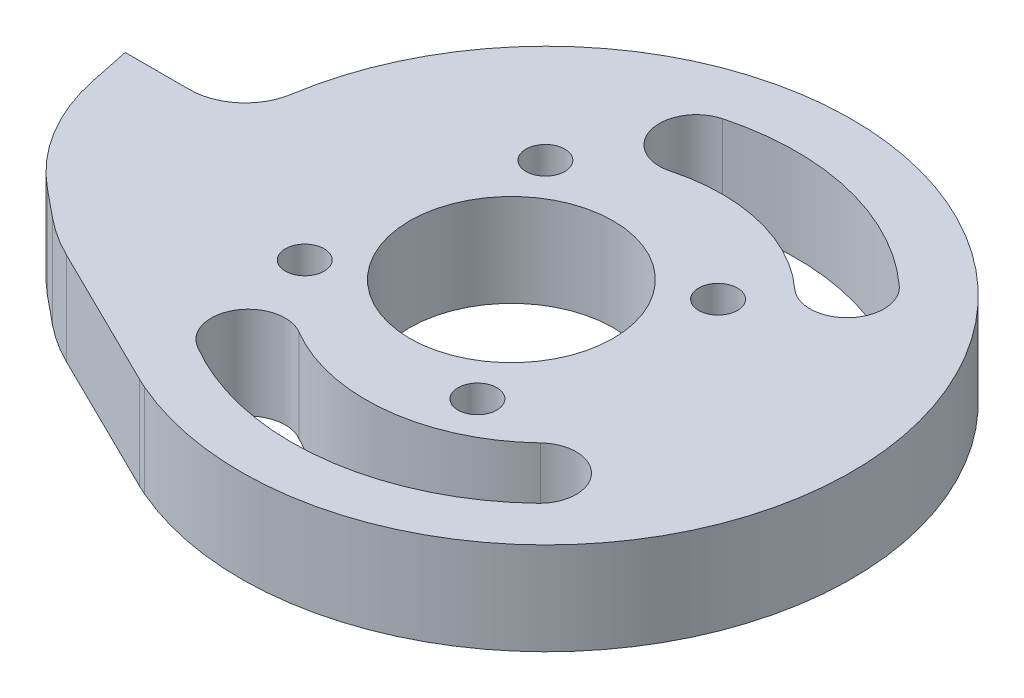
ISO-10303-21;
HEADER;
FILE_DESCRIPTION(('STEP AP214'),'2;1');
FILE_NAME('part.step','',(''),(''),'','','');
FILE_SCHEMA(('AUTOMOTIVE_DESIGN { 1 0 10303 214 1 1 1 1 }'));
ENDSEC;
DATA;
#1=APPLICATION_CONTEXT('core data for automotive mechanical design processes');
#2=APPLICATION_PROTOCOL_DEFINITION('international standard','automotive_design',2000,#1);
#3=PRODUCT_CONTEXT('',#1,'mechanical');
#4=PRODUCT('Part','Part','',(#3));
#5=PRODUCT_RELATED_PRODUCT_CATEGORY('part','',(#4));
#6=PRODUCT_DEFINITION_FORMATION('','',#4);
#7=PRODUCT_DEFINITION_CONTEXT('part definition',#1,'design');
#8=PRODUCT_DEFINITION('design','',#6,#7);
#9=PRODUCT_DEFINITION_SHAPE('','',#8);
#10=(LENGTH_UNIT() NAMED_UNIT(*) SI_UNIT(.MILLI.,.METRE.));
#11=(NAMED_UNIT(*) PLANE_ANGLE_UNIT() SI_UNIT($,.RADIAN.));
#12=(NAMED_UNIT(*) SI_UNIT($,.STERADIAN.) SOLID_ANGLE_UNIT());
#13=UNCERTAINTY_MEASURE_WITH_UNIT(LENGTH_MEASURE(1.E-05),#10,'distance_accuracy_value','');
#14=(GEOMETRIC_REPRESENTATION_CONTEXT(3) GLOBAL_UNCERTAINTY_ASSIGNED_CONTEXT((#13)) GLOBAL_UNIT_ASSIGNED_CONTEXT((#10,
#11,#12)) REPRESENTATION_CONTEXT('',''));
#15=CARTESIAN_POINT('',(0.,0.,0.));
#16=DIRECTION('',(0.,0.,1.));
#17=DIRECTION('',(1.,0.,0.));
#18=AXIS2_PLACEMENT_3D('',#15,#16,#17);
#19=CARTESIAN_POINT('',(0.,10.,0.));
#20=DIRECTION('',(0.,-1.,0.));
#21=DIRECTION('',(0.,0.,-1.));
#22=AXIS2_PLACEMENT_3D('',#19,#20,#21);
#23=PLANE('',#22);
#24=CARTESIAN_POINT('',(0.,10.,0.));
#25=DIRECTION('',(0.,1.,0.));
#26=DIRECTION('',(0.,0.,1.));
#27=AXIS2_PLACEMENT_3D('',#24,#25,#26);
#28=CIRCLE('',#27,27.5);
#29=CARTESIAN_POINT('',(-14.0425531914894,10.,23.6443798790366));
#30=VERTEX_POINT('',#29);
#31=CARTESIAN_POINT('',(18.9866795888795,10.,19.8936170212766));
#32=VERTEX_POINT('',#31);
#33=EDGE_CURVE('E189',#30,#32,#28,.T.);
#34=ORIENTED_EDGE('',*,*,#33,.F.);
#35=CARTESIAN_POINT('',(-12.,10.,20.2051973511768));
#36=DIRECTION('',(0.,1.,0.));
#37=DIRECTION('',(0.,0.,1.));
#38=AXIS2_PLACEMENT_3D('',#35,#36,#37);
#39=CIRCLE('',#38,4.);
#40=CARTESIAN_POINT('',(-9.95744680851064,10.,16.7660148233169));
#41=VERTEX_POINT('',#40);
#42=EDGE_CURVE('E162',#41,#30,#39,.T.);
#43=ORIENTED_EDGE('',*,*,#42,.F.);
#44=CARTESIAN_POINT('',(0.,10.,0.));
#45=DIRECTION('',(0.,-1.,0.));
#46=DIRECTION('',(0.,0.,1.));
#47=AXIS2_PLACEMENT_3D('',#44,#45,#46);
#48=CIRCLE('',#47,19.5);
#49=CARTESIAN_POINT('',(13.4632818902964,10.,14.1063829787234));
#50=VERTEX_POINT('',#49);
#51=EDGE_CURVE('E180',#50,#41,#48,.T.);
#52=ORIENTED_EDGE('',*,*,#51,.F.);
#53=CARTESIAN_POINT('',(16.224980739588,10.,17.));
#54=DIRECTION('',(0.,1.,0.));
#55=DIRECTION('',(0.,0.,1.));
#56=AXIS2_PLACEMENT_3D('',#53,#54,#55);
#57=CIRCLE('',#56,4.);
#58=EDGE_CURVE('E183',#32,#50,#57,.T.);
#59=ORIENTED_EDGE('',*,*,#58,.F.);
#60=EDGE_LOOP('',(#34,#43,#52,#59));
#61=FACE_BOUND('',#60,.T.);
#62=CARTESIAN_POINT('',(0.,10.,0.));
#63=DIRECTION('',(0.,1.,0.));
#64=DIRECTION('',(0.,0.,1.));
#65=AXIS2_PLACEMENT_3D('',#62,#63,#64);
#66=CIRCLE('',#65,27.);
#67=CARTESIAN_POINT('',(18.1861826691479,10.,-19.9565217391304));
#68=VERTEX_POINT('',#67);
#69=CARTESIAN_POINT('',(-7.04347826086956,10.,-26.0650995392049));
#70=VERTEX_POINT('',#69);
#71=EDGE_CURVE('E216',#68,#70,#66,.T.);
#72=ORIENTED_EDGE('',*,*,#71,.F.);
#73=CARTESIAN_POINT('',(15.4919333848297,10.,-17.));
#74=DIRECTION('',(0.,1.,0.));
#75=DIRECTION('',(0.,0.,1.));
#76=AXIS2_PLACEMENT_3D('',#73,#74,#75);
#77=CIRCLE('',#76,4.);
#78=CARTESIAN_POINT('',(12.7976841005115,10.,-14.0434782608696));
#79=VERTEX_POINT('',#78);
#80=EDGE_CURVE('E214',#79,#68,#77,.T.);
#81=ORIENTED_EDGE('',*,*,#80,.F.);
#82=CARTESIAN_POINT('',(0.,10.,0.));
#83=DIRECTION('',(0.,-1.,0.));
#84=DIRECTION('',(0.,0.,1.));
#85=AXIS2_PLACEMENT_3D('',#82,#83,#84);
#86=CIRCLE('',#85,19.);
#87=CARTESIAN_POINT('',(-4.95652173913044,10.,-18.3421070831442));
#88=VERTEX_POINT('',#87);
#89=EDGE_CURVE('E204',#88,#79,#86,.T.);
#90=ORIENTED_EDGE('',*,*,#89,.F.);
#91=CARTESIAN_POINT('',(-6.,10.,-22.2036033111745));
#92=DIRECTION('',(0.,1.,0.));
#93=DIRECTION('',(0.,0.,1.));
#94=AXIS2_PLACEMENT_3D('',#91,#92,#93);
#95=CIRCLE('',#94,4.);
#96=EDGE_CURVE('E219',#70,#88,#95,.T.);
#97=ORIENTED_EDGE('',*,*,#96,.F.);
#98=EDGE_LOOP('',(#72,#81,#90,#97));
#99=FACE_BOUND('',#98,.T.);
#100=CARTESIAN_POINT('',(-12.7073790530888,10.,-12.61));
#101=DIRECTION('',(0.,1.,0.));
#102=DIRECTION('',(0.,0.,1.));
#103=AXIS2_PLACEMENT_3D('',#100,#101,#102);
#104=CIRCLE('',#103,2.1);
#105=CARTESIAN_POINT('',(-12.7073790530888,10.,-10.51));
#106=VERTEX_POINT('',#105);
#107=EDGE_CURVE('E196',#106,#106,#104,.T.);
#108=ORIENTED_EDGE('',*,*,#107,.F.);
#109=EDGE_LOOP('',(#108));
#110=FACE_BOUND('',#109,.T.);
#111=CARTESIAN_POINT('',(-16.38,10.,9.71737905308882));
#112=DIRECTION('',(0.,1.,0.));
#113=DIRECTION('',(0.,0.,1.));
#114=AXIS2_PLACEMENT_3D('',#111,#112,#113);
#115=CIRCLE('',#114,2.1);
#116=CARTESIAN_POINT('',(-16.38,10.,11.8173790530888));
#117=VERTEX_POINT('',#116);
#118=EDGE_CURVE('E241',#117,#117,#115,.T.);
#119=ORIENTED_EDGE('',*,*,#118,.F.);
#120=EDGE_LOOP('',(#119));
#121=FACE_BOUND('',#120,.T.);
#122=CARTESIAN_POINT('',(5.94737905308882,10.,13.39));
#123=DIRECTION('',(0.,1.,0.));
#124=DIRECTION('',(0.,0.,1.));
#125=AXIS2_PLACEMENT_3D('',#122,#123,#124);
#126=CIRCLE('',#125,2.09999999999999);
#127=CARTESIAN_POINT('',(5.94737905308882,10.,15.49));
#128=VERTEX_POINT('',#127);
#129=EDGE_CURVE('E235',#128,#128,#126,.T.);
#130=ORIENTED_EDGE('',*,*,#129,.F.);
#131=EDGE_LOOP('',(#130));
#132=FACE_BOUND('',#131,.T.);
#133=CARTESIAN_POINT('',(9.62,10.,-8.93737905308882));
#134=DIRECTION('',(0.,1.,0.));
#135=DIRECTION('',(0.,0.,1.));
#136=AXIS2_PLACEMENT_3D('',#133,#134,#135);
#137=CIRCLE('',#136,2.1);
#138=CARTESIAN_POINT('',(9.62,10.,-6.83737905308882));
#139=VERTEX_POINT('',#138);
#140=EDGE_CURVE('E234',#139,#139,#137,.T.);
#141=ORIENTED_EDGE('',*,*,#140,.F.);
#142=EDGE_LOOP('',(#141));
#143=FACE_BOUND('',#142,.T.);
#144=DIRECTION('',(0.896892718197446,0.,0.442248179243732));
#145=VECTOR('',#144,1.);
#146=CARTESIAN_POINT('',(-32.,10.,21.));
#147=LINE('',#146,#145);
#148=CARTESIAN_POINT('',(-29.7445383063231,10.,22.1121439689992));
#149=VERTEX_POINT('',#148);
#150=CARTESIAN_POINT('',(-14.1030942068052,10.,29.8247722838514));
#151=VERTEX_POINT('',#150);
#152=EDGE_CURVE('E270',#149,#151,#147,.T.);
#153=ORIENTED_EDGE('',*,*,#152,.T.);
#154=CARTESIAN_POINT('',(-4.3736342634431,10.,10.0931324835076));
#155=DIRECTION('',(0.,-1.,0.));
#156=DIRECTION('',(0.,0.,-1.));
#157=AXIS2_PLACEMENT_3D('',#154,#155,#156);
#158=CIRCLE('',#157,22.);
#159=CARTESIAN_POINT('',(-13.1209027903293,10.,30.2793974505228));
#160=VERTEX_POINT('',#159);
#161=EDGE_CURVE('E314',#151,#160,#158,.F.);
#162=ORIENTED_EDGE('',*,*,#161,.T.);
#163=CARTESIAN_POINT('',(0.,10.,0.));
#164=DIRECTION('',(0.,1.,0.));
#165=DIRECTION('',(0.,0.,-1.));
#166=AXIS2_PLACEMENT_3D('',#163,#164,#165);
#167=CIRCLE('',#166,33.);
#168=CARTESIAN_POINT('',(-32.6071288535346,10.,-5.07692307692307));
#169=VERTEX_POINT('',#168);
#170=EDGE_CURVE('E261',#160,#169,#167,.T.);
#171=ORIENTED_EDGE('',*,*,#170,.T.);
#172=CARTESIAN_POINT('',(-38.5356977359954,10.,-6.));
#173=DIRECTION('',(0.,-1.,0.));
#174=DIRECTION('',(0.,0.,-1.));
#175=AXIS2_PLACEMENT_3D('',#172,#173,#174);
#176=CIRCLE('',#175,6.);
#177=CARTESIAN_POINT('',(-38.5356977359954,10.,0.));
#178=VERTEX_POINT('',#177);
#179=EDGE_CURVE('E295',#169,#178,#176,.T.);
#180=ORIENTED_EDGE('',*,*,#179,.T.);
#181=DIRECTION('',(-1.,0.,0.));
#182=VECTOR('',#181,1.);
#183=CARTESIAN_POINT('',(-33.,10.,0.));
#184=LINE('',#183,#182);
#185=CARTESIAN_POINT('',(-45.5,10.,0.));
#186=VERTEX_POINT('',#185);
#187=EDGE_CURVE('E263',#178,#186,#184,.T.);
#188=ORIENTED_EDGE('',*,*,#187,.T.);
#189=DIRECTION('',(0.203954254112001,0.,0.978980419737605));
#190=VECTOR('',#189,1.);
#191=CARTESIAN_POINT('',(-45.5,10.,0.));
#192=LINE('',#191,#190);
#193=CARTESIAN_POINT('',(-44.586385759703,10.,4.38534835342558));
#194=VERTEX_POINT('',#193);
#195=EDGE_CURVE('E266',#186,#194,#192,.T.);
#196=ORIENTED_EDGE('',*,*,#195,.T.);
#197=CARTESIAN_POINT('',(-23.0488165254757,10.,-0.101645237038444));
#198=DIRECTION('',(0.,-1.,0.));
#199=DIRECTION('',(0.,0.,-1.));
#200=AXIS2_PLACEMENT_3D('',#197,#198,#199);
#201=CIRCLE('',#200,22.);
#202=CARTESIAN_POINT('',(-36.9800479111355,10.,16.9254153454346));
#203=VERTEX_POINT('',#202);
#204=EDGE_CURVE('E57',#194,#203,#201,.F.);
#205=ORIENTED_EDGE('',*,*,#204,.T.);
#206=DIRECTION('',(0.773957299203321,0.,0.633237790257263));
#207=VECTOR('',#206,1.);
#208=CARTESIAN_POINT('',(-43.,10.,12.));
#209=LINE('',#208,#207);
#210=CARTESIAN_POINT('',(-33.9463097486208,10.,19.4075647511284));
#211=VERTEX_POINT('',#210);
#212=EDGE_CURVE('E268',#203,#211,#209,.T.);
#213=ORIENTED_EDGE('',*,*,#212,.T.);
#214=CARTESIAN_POINT('',(-20.015078362961,10.,2.38050416865538));
#215=DIRECTION('',(0.,-1.,0.));
#216=DIRECTION('',(0.,0.,-1.));
#217=AXIS2_PLACEMENT_3D('',#214,#215,#216);
#218=CIRCLE('',#217,22.);
#219=EDGE_CURVE('E312',#211,#149,#218,.F.);
#220=ORIENTED_EDGE('',*,*,#219,.T.);
#221=EDGE_LOOP('',(#153,#162,#171,#180,#188,#196,#205,#213,#220));
#222=FACE_BOUND('',#221,.T.);
#223=CARTESIAN_POINT('',(-3.38,10.,0.39));
#224=DIRECTION('',(0.,1.,0.));
#225=DIRECTION('',(0.,0.,1.));
#226=AXIS2_PLACEMENT_3D('',#223,#224,#225);
#227=CIRCLE('',#226,11.);
#228=CARTESIAN_POINT('',(-3.38,10.,11.39));
#229=VERTEX_POINT('',#228);
#230=EDGE_CURVE('E255',#229,#229,#227,.T.);
#231=ORIENTED_EDGE('',*,*,#230,.F.);
#232=EDGE_LOOP('',(#231));
#233=FACE_BOUND('',#232,.T.);
#234=ADVANCED_FACE('F36',(#61,#99,#110,#121,#132,#143,#222,#233),#23,.F.);
#235=CARTESIAN_POINT('',(0.,0.,0.));
#236=DIRECTION('',(0.,-1.,0.));
#237=DIRECTION('',(0.,0.,-1.));
#238=AXIS2_PLACEMENT_3D('',#235,#236,#237);
#239=PLANE('',#238);
#240=CARTESIAN_POINT('',(-12.,0.,20.2051973511768));
#241=DIRECTION('',(0.,1.,0.));
#242=DIRECTION('',(0.,0.,1.));
#243=AXIS2_PLACEMENT_3D('',#240,#241,#242);
#244=CIRCLE('',#243,4.);
#245=CARTESIAN_POINT('',(-9.95744680851064,0.,16.7660148233169));
#246=VERTEX_POINT('',#245);
#247=CARTESIAN_POINT('',(-14.0425531914894,0.,23.6443798790366));
#248=VERTEX_POINT('',#247);
#249=EDGE_CURVE('E159',#246,#248,#244,.T.);
#250=ORIENTED_EDGE('',*,*,#249,.T.);
#251=CARTESIAN_POINT('',(0.,0.,0.));
#252=DIRECTION('',(0.,1.,0.));
#253=DIRECTION('',(0.,0.,1.));
#254=AXIS2_PLACEMENT_3D('',#251,#252,#253);
#255=CIRCLE('',#254,27.5);
#256=CARTESIAN_POINT('',(18.9866795888795,0.,19.8936170212766));
#257=VERTEX_POINT('',#256);
#258=EDGE_CURVE('E171',#248,#257,#255,.T.);
#259=ORIENTED_EDGE('',*,*,#258,.T.);
#260=CARTESIAN_POINT('',(16.224980739588,0.,17.));
#261=DIRECTION('',(0.,1.,0.));
#262=DIRECTION('',(0.,0.,1.));
#263=AXIS2_PLACEMENT_3D('',#260,#261,#262);
#264=CIRCLE('',#263,4.);
#265=CARTESIAN_POINT('',(13.4632818902964,0.,14.1063829787234));
#266=VERTEX_POINT('',#265);
#267=EDGE_CURVE('E175',#257,#266,#264,.T.);
#268=ORIENTED_EDGE('',*,*,#267,.T.);
#269=CARTESIAN_POINT('',(0.,0.,0.));
#270=DIRECTION('',(0.,-1.,0.));
#271=DIRECTION('',(0.,0.,1.));
#272=AXIS2_PLACEMENT_3D('',#269,#270,#271);
#273=CIRCLE('',#272,19.5);
#274=EDGE_CURVE('E167',#266,#246,#273,.T.);
#275=ORIENTED_EDGE('',*,*,#274,.T.);
#276=EDGE_LOOP('',(#250,#259,#268,#275));
#277=FACE_BOUND('',#276,.T.);
#278=CARTESIAN_POINT('',(15.4919333848297,0.,-17.));
#279=DIRECTION('',(0.,1.,0.));
#280=DIRECTION('',(0.,0.,1.));
#281=AXIS2_PLACEMENT_3D('',#278,#279,#280);
#282=CIRCLE('',#281,4.);
#283=CARTESIAN_POINT('',(12.7976841005115,0.,-14.0434782608696));
#284=VERTEX_POINT('',#283);
#285=CARTESIAN_POINT('',(18.1861826691479,0.,-19.9565217391304));
#286=VERTEX_POINT('',#285);
#287=EDGE_CURVE('E200',#284,#286,#282,.T.);
#288=ORIENTED_EDGE('',*,*,#287,.T.);
#289=CARTESIAN_POINT('',(0.,0.,0.));
#290=DIRECTION('',(0.,1.,0.));
#291=DIRECTION('',(0.,0.,1.));
#292=AXIS2_PLACEMENT_3D('',#289,#290,#291);
#293=CIRCLE('',#292,27.);
#294=CARTESIAN_POINT('',(-7.04347826086956,0.,-26.0650995392049));
#295=VERTEX_POINT('',#294);
#296=EDGE_CURVE('E203',#286,#295,#293,.T.);
#297=ORIENTED_EDGE('',*,*,#296,.T.);
#298=CARTESIAN_POINT('',(-6.,0.,-22.2036033111745));
#299=DIRECTION('',(0.,1.,0.));
#300=DIRECTION('',(0.,0.,1.));
#301=AXIS2_PLACEMENT_3D('',#298,#299,#300);
#302=CIRCLE('',#301,4.);
#303=CARTESIAN_POINT('',(-4.95652173913044,0.,-18.3421070831442));
#304=VERTEX_POINT('',#303);
#305=EDGE_CURVE('E207',#295,#304,#302,.T.);
#306=ORIENTED_EDGE('',*,*,#305,.T.);
#307=CARTESIAN_POINT('',(0.,0.,0.));
#308=DIRECTION('',(0.,-1.,0.));
#309=DIRECTION('',(0.,0.,1.));
#310=AXIS2_PLACEMENT_3D('',#307,#308,#309);
#311=CIRCLE('',#310,19.);
#312=EDGE_CURVE('E210',#304,#284,#311,.T.);
#313=ORIENTED_EDGE('',*,*,#312,.T.);
#314=EDGE_LOOP('',(#288,#297,#306,#313));
#315=FACE_BOUND('',#314,.T.);
#316=CARTESIAN_POINT('',(-12.7073790530888,0.,-12.61));
#317=DIRECTION('',(0.,1.,0.));
#318=DIRECTION('',(0.,0.,1.));
#319=AXIS2_PLACEMENT_3D('',#316,#317,#318);
#320=CIRCLE('',#319,2.1);
#321=CARTESIAN_POINT('',(-12.7073790530888,0.,-10.51));
#322=VERTEX_POINT('',#321);
#323=EDGE_CURVE('E244',#322,#322,#320,.T.);
#324=ORIENTED_EDGE('',*,*,#323,.T.);
#325=EDGE_LOOP('',(#324));
#326=FACE_BOUND('',#325,.T.);
#327=CARTESIAN_POINT('',(-16.38,0.,9.71737905308882));
#328=DIRECTION('',(0.,1.,0.));
#329=DIRECTION('',(0.,0.,1.));
#330=AXIS2_PLACEMENT_3D('',#327,#328,#329);
#331=CIRCLE('',#330,2.1);
#332=CARTESIAN_POINT('',(-16.38,0.,11.8173790530888));
#333=VERTEX_POINT('',#332);
#334=EDGE_CURVE('E238',#333,#333,#331,.T.);
#335=ORIENTED_EDGE('',*,*,#334,.T.);
#336=EDGE_LOOP('',(#335));
#337=FACE_BOUND('',#336,.T.);
#338=CARTESIAN_POINT('',(5.94737905308882,0.,13.39));
#339=DIRECTION('',(0.,1.,0.));
#340=DIRECTION('',(0.,0.,1.));
#341=AXIS2_PLACEMENT_3D('',#338,#339,#340);
#342=CIRCLE('',#341,2.09999999999999);
#343=CARTESIAN_POINT('',(5.94737905308882,0.,15.49));
#344=VERTEX_POINT('',#343);
#345=EDGE_CURVE('E231',#344,#344,#342,.T.);
#346=ORIENTED_EDGE('',*,*,#345,.T.);
#347=EDGE_LOOP('',(#346));
#348=FACE_BOUND('',#347,.T.);
#349=CARTESIAN_POINT('',(9.62,0.,-8.93737905308882));
#350=DIRECTION('',(0.,1.,0.));
#351=DIRECTION('',(0.,0.,1.));
#352=AXIS2_PLACEMENT_3D('',#349,#350,#351);
#353=CIRCLE('',#352,2.1);
#354=CARTESIAN_POINT('',(9.62,0.,-6.83737905308882));
#355=VERTEX_POINT('',#354);
#356=EDGE_CURVE('E249',#355,#355,#353,.T.);
#357=ORIENTED_EDGE('',*,*,#356,.T.);
#358=EDGE_LOOP('',(#357));
#359=FACE_BOUND('',#358,.T.);
#360=CARTESIAN_POINT('',(0.,0.,0.));
#361=DIRECTION('',(0.,1.,0.));
#362=DIRECTION('',(0.,0.,-1.));
#363=AXIS2_PLACEMENT_3D('',#360,#361,#362);
#364=CIRCLE('',#363,33.);
#365=CARTESIAN_POINT('',(-13.1209027903293,0.,30.2793974505228));
#366=VERTEX_POINT('',#365);
#367=CARTESIAN_POINT('',(-32.6071288535346,0.,-5.07692307692307));
#368=VERTEX_POINT('',#367);
#369=EDGE_CURVE('E258',#366,#368,#364,.T.);
#370=ORIENTED_EDGE('',*,*,#369,.F.);
#371=CARTESIAN_POINT('',(-4.3736342634431,0.,10.0931324835076));
#372=DIRECTION('',(0.,-1.,0.));
#373=DIRECTION('',(0.,0.,-1.));
#374=AXIS2_PLACEMENT_3D('',#371,#372,#373);
#375=CIRCLE('',#374,22.);
#376=CARTESIAN_POINT('',(-14.1030942068052,0.,29.8247722838514));
#377=VERTEX_POINT('',#376);
#378=EDGE_CURVE('E304',#366,#377,#375,.T.);
#379=ORIENTED_EDGE('',*,*,#378,.T.);
#380=DIRECTION('',(0.896892718197446,0.,0.442248179243732));
#381=VECTOR('',#380,1.);
#382=CARTESIAN_POINT('',(-32.,0.,21.));
#383=LINE('',#382,#381);
#384=CARTESIAN_POINT('',(-29.7445383063231,0.,22.1121439689992));
#385=VERTEX_POINT('',#384);
#386=EDGE_CURVE('E264',#385,#377,#383,.T.);
#387=ORIENTED_EDGE('',*,*,#386,.F.);
#388=CARTESIAN_POINT('',(-20.015078362961,0.,2.38050416865538));
#389=DIRECTION('',(0.,-1.,0.));
#390=DIRECTION('',(0.,0.,-1.));
#391=AXIS2_PLACEMENT_3D('',#388,#389,#390);
#392=CIRCLE('',#391,22.);
#393=CARTESIAN_POINT('',(-33.9463097486208,0.,19.4075647511284));
#394=VERTEX_POINT('',#393);
#395=EDGE_CURVE('E302',#385,#394,#392,.T.);
#396=ORIENTED_EDGE('',*,*,#395,.T.);
#397=DIRECTION('',(0.773957299203321,0.,0.633237790257263));
#398=VECTOR('',#397,1.);
#399=CARTESIAN_POINT('',(-43.,0.,12.));
#400=LINE('',#399,#398);
#401=CARTESIAN_POINT('',(-36.9800479111355,0.,16.9254153454346));
#402=VERTEX_POINT('',#401);
#403=EDGE_CURVE('E280',#402,#394,#400,.T.);
#404=ORIENTED_EDGE('',*,*,#403,.F.);
#405=CARTESIAN_POINT('',(-23.0488165254757,0.,-0.101645237038444));
#406=DIRECTION('',(0.,-1.,0.));
#407=DIRECTION('',(0.,0.,-1.));
#408=AXIS2_PLACEMENT_3D('',#405,#406,#407);
#409=CIRCLE('',#408,22.);
#410=CARTESIAN_POINT('',(-44.586385759703,0.,4.38534835342558));
#411=VERTEX_POINT('',#410);
#412=EDGE_CURVE('E300',#402,#411,#409,.T.);
#413=ORIENTED_EDGE('',*,*,#412,.T.);
#414=DIRECTION('',(0.203954254112001,0.,0.978980419737605));
#415=VECTOR('',#414,1.);
#416=CARTESIAN_POINT('',(-45.5,0.,0.));
#417=LINE('',#416,#415);
#418=CARTESIAN_POINT('',(-45.5,0.,0.));
#419=VERTEX_POINT('',#418);
#420=EDGE_CURVE('E277',#419,#411,#417,.T.);
#421=ORIENTED_EDGE('',*,*,#420,.F.);
#422=DIRECTION('',(-1.,0.,0.));
#423=VECTOR('',#422,1.);
#424=CARTESIAN_POINT('',(-33.,0.,0.));
#425=LINE('',#424,#423);
#426=CARTESIAN_POINT('',(-38.5356977359954,0.,0.));
#427=VERTEX_POINT('',#426);
#428=EDGE_CURVE('E275',#427,#419,#425,.T.);
#429=ORIENTED_EDGE('',*,*,#428,.F.);
#430=CARTESIAN_POINT('',(-38.5356977359954,0.,-6.));
#431=DIRECTION('',(0.,-1.,0.));
#432=DIRECTION('',(0.,0.,-1.));
#433=AXIS2_PLACEMENT_3D('',#430,#431,#432);
#434=CIRCLE('',#433,6.);
#435=EDGE_CURVE('E292',#427,#368,#434,.F.);
#436=ORIENTED_EDGE('',*,*,#435,.T.);
#437=EDGE_LOOP('',(#370,#379,#387,#396,#404,#413,#421,#429,#436));
#438=FACE_BOUND('',#437,.T.);
#439=CARTESIAN_POINT('',(-3.38,0.,0.39));
#440=DIRECTION('',(0.,1.,0.));
#441=DIRECTION('',(0.,0.,1.));
#442=AXIS2_PLACEMENT_3D('',#439,#440,#441);
#443=CIRCLE('',#442,11.);
#444=CARTESIAN_POINT('',(-3.38,0.,11.39));
#445=VERTEX_POINT('',#444);
#446=EDGE_CURVE('E252',#445,#445,#443,.T.);
#447=ORIENTED_EDGE('',*,*,#446,.T.);
#448=EDGE_LOOP('',(#447));
#449=FACE_BOUND('',#448,.T.);
#450=ADVANCED_FACE('F177',(#277,#315,#326,#337,#348,#359,#438,#449),#239,.T.);
#451=CARTESIAN_POINT('',(0.,10.,0.));
#452=DIRECTION('',(0.,-1.,0.));
#453=DIRECTION('',(0.,0.,-1.));
#454=AXIS2_PLACEMENT_3D('',#451,#452,#453);
#455=CYLINDRICAL_SURFACE('',#454,33.);
#456=ORIENTED_EDGE('',*,*,#170,.F.);
#457=DIRECTION('',(0.,-1.,0.));
#458=VECTOR('',#457,1.);
#459=CARTESIAN_POINT('',(-13.1209027903293,10.,30.2793974505228));
#460=LINE('',#459,#458);
#461=EDGE_CURVE('E297',#160,#366,#460,.T.);
#462=ORIENTED_EDGE('',*,*,#461,.T.);
#463=ORIENTED_EDGE('',*,*,#369,.T.);
#464=DIRECTION('',(0.,-1.,0.));
#465=VECTOR('',#464,1.);
#466=CARTESIAN_POINT('',(-32.6071288535346,10.,-5.07692307692307));
#467=LINE('',#466,#465);
#468=EDGE_CURVE('E289',#368,#169,#467,.F.);
#469=ORIENTED_EDGE('',*,*,#468,.T.);
#470=EDGE_LOOP('',(#456,#462,#463,#469));
#471=FACE_BOUND('',#470,.T.);
#472=ADVANCED_FACE('F342',(#471),#455,.T.);
#473=CARTESIAN_POINT('',(-33.,10.,0.));
#474=DIRECTION('',(0.,0.,1.));
#475=DIRECTION('',(1.,0.,0.));
#476=AXIS2_PLACEMENT_3D('',#473,#474,#475);
#477=PLANE('',#476);
#478=ORIENTED_EDGE('',*,*,#187,.F.);
#479=DIRECTION('',(0.,1.,0.));
#480=VECTOR('',#479,1.);
#481=CARTESIAN_POINT('',(-38.5356977359954,0.,0.));
#482=LINE('',#481,#480);
#483=EDGE_CURVE('E286',#178,#427,#482,.F.);
#484=ORIENTED_EDGE('',*,*,#483,.T.);
#485=ORIENTED_EDGE('',*,*,#428,.T.);
#486=DIRECTION('',(0.,-1.,0.));
#487=VECTOR('',#486,1.);
#488=CARTESIAN_POINT('',(-45.5,10.,0.));
#489=LINE('',#488,#487);
#490=EDGE_CURVE('E273',#186,#419,#489,.T.);
#491=ORIENTED_EDGE('',*,*,#490,.F.);
#492=EDGE_LOOP('',(#478,#484,#485,#491));
#493=FACE_BOUND('',#492,.T.);
#494=ADVANCED_FACE('F352',(#493),#477,.F.);
#495=CARTESIAN_POINT('',(-45.5,10.,0.));
#496=DIRECTION('',(0.978980419737605,0.,-0.203954254112001));
#497=DIRECTION('',(-0.203954254112001,0.,-0.978980419737605));
#498=AXIS2_PLACEMENT_3D('',#495,#496,#497);
#499=PLANE('',#498);
#500=ORIENTED_EDGE('',*,*,#420,.T.);
#501=DIRECTION('',(0.,-1.,0.));
#502=VECTOR('',#501,1.);
#503=CARTESIAN_POINT('',(-44.586385759703,10.,4.38534835342558));
#504=LINE('',#503,#502);
#505=EDGE_CURVE('E11',#411,#194,#504,.F.);
#506=ORIENTED_EDGE('',*,*,#505,.T.);
#507=ORIENTED_EDGE('',*,*,#195,.F.);
#508=ORIENTED_EDGE('',*,*,#490,.T.);
#509=EDGE_LOOP('',(#500,#506,#507,#508));
#510=FACE_BOUND('',#509,.T.);
#511=ADVANCED_FACE('F355',(#510),#499,.F.);
#512=CARTESIAN_POINT('',(-43.,10.,12.));
#513=DIRECTION('',(0.633237790257263,0.,-0.773957299203321));
#514=DIRECTION('',(-0.773957299203321,0.,-0.633237790257263));
#515=AXIS2_PLACEMENT_3D('',#512,#513,#514);
#516=PLANE('',#515);
#517=ORIENTED_EDGE('',*,*,#403,.T.);
#518=DIRECTION('',(0.,-1.,0.));
#519=VECTOR('',#518,1.);
#520=CARTESIAN_POINT('',(-33.9463097486208,10.,19.4075647511284));
#521=LINE('',#520,#519);
#522=EDGE_CURVE('E44',#394,#211,#521,.F.);
#523=ORIENTED_EDGE('',*,*,#522,.T.);
#524=ORIENTED_EDGE('',*,*,#212,.F.);
#525=DIRECTION('',(0.,-1.,0.));
#526=VECTOR('',#525,1.);
#527=CARTESIAN_POINT('',(-36.9800479111355,10.,16.9254153454346));
#528=LINE('',#527,#526);
#529=EDGE_CURVE('E316',#203,#402,#528,.T.);
#530=ORIENTED_EDGE('',*,*,#529,.T.);
#531=EDGE_LOOP('',(#517,#523,#524,#530));
#532=FACE_BOUND('',#531,.T.);
#533=ADVANCED_FACE('F320',(#532),#516,.F.);
#534=CARTESIAN_POINT('',(-32.,10.,21.));
#535=DIRECTION('',(0.442248179243732,0.,-0.896892718197446));
#536=DIRECTION('',(-0.896892718197447,0.,-0.442248179243732));
#537=AXIS2_PLACEMENT_3D('',#534,#535,#536);
#538=PLANE('',#537);
#539=ORIENTED_EDGE('',*,*,#386,.T.);
#540=DIRECTION('',(0.,-1.,0.));
#541=VECTOR('',#540,1.);
#542=CARTESIAN_POINT('',(-14.1030942068052,10.,29.8247722838514));
#543=LINE('',#542,#541);
#544=EDGE_CURVE('E309',#377,#151,#543,.F.);
#545=ORIENTED_EDGE('',*,*,#544,.T.);
#546=ORIENTED_EDGE('',*,*,#152,.F.);
#547=DIRECTION('',(0.,-1.,0.));
#548=VECTOR('',#547,1.);
#549=CARTESIAN_POINT('',(-29.7445383063231,10.,22.1121439689992));
#550=LINE('',#549,#548);
#551=EDGE_CURVE('E306',#149,#385,#550,.T.);
#552=ORIENTED_EDGE('',*,*,#551,.T.);
#553=EDGE_LOOP('',(#539,#545,#546,#552));
#554=FACE_BOUND('',#553,.T.);
#555=ADVANCED_FACE('F333',(#554),#538,.F.);
#556=CARTESIAN_POINT('',(-3.38,10.,0.39));
#557=DIRECTION('',(0.,-1.,0.));
#558=DIRECTION('',(0.,0.,-1.));
#559=AXIS2_PLACEMENT_3D('',#556,#557,#558);
#560=CYLINDRICAL_SURFACE('',#559,11.);
#561=ORIENTED_EDGE('',*,*,#230,.T.);
#562=EDGE_LOOP('',(#561));
#563=FACE_BOUND('',#562,.T.);
#564=ORIENTED_EDGE('',*,*,#446,.F.);
#565=EDGE_LOOP('',(#564));
#566=FACE_BOUND('',#565,.T.);
#567=ADVANCED_FACE('F370',(#563,#566),#560,.F.);
#568=CARTESIAN_POINT('',(9.62,0.,-8.93737905308882));
#569=DIRECTION('',(0.,1.,0.));
#570=DIRECTION('',(0.,0.,1.));
#571=AXIS2_PLACEMENT_3D('',#568,#569,#570);
#572=CYLINDRICAL_SURFACE('',#571,2.1);
#573=ORIENTED_EDGE('',*,*,#356,.F.);
#574=EDGE_LOOP('',(#573));
#575=FACE_BOUND('',#574,.T.);
#576=ORIENTED_EDGE('',*,*,#140,.T.);
#577=EDGE_LOOP('',(#576));
#578=FACE_BOUND('',#577,.T.);
#579=ADVANCED_FACE('F503',(#575,#578),#572,.F.);
#580=CARTESIAN_POINT('',(5.94737905308882,0.,13.39));
#581=DIRECTION('',(0.,1.,0.));
#582=DIRECTION('',(0.,0.,1.));
#583=AXIS2_PLACEMENT_3D('',#580,#581,#582);
#584=CYLINDRICAL_SURFACE('',#583,2.09999999999999);
#585=ORIENTED_EDGE('',*,*,#345,.F.);
#586=EDGE_LOOP('',(#585));
#587=FACE_BOUND('',#586,.T.);
#588=ORIENTED_EDGE('',*,*,#129,.T.);
#589=EDGE_LOOP('',(#588));
#590=FACE_BOUND('',#589,.T.);
#591=ADVANCED_FACE('F494',(#587,#590),#584,.F.);
#592=CARTESIAN_POINT('',(-16.38,0.,9.71737905308882));
#593=DIRECTION('',(0.,1.,0.));
#594=DIRECTION('',(0.,0.,1.));
#595=AXIS2_PLACEMENT_3D('',#592,#593,#594);
#596=CYLINDRICAL_SURFACE('',#595,2.1);
#597=ORIENTED_EDGE('',*,*,#334,.F.);
#598=EDGE_LOOP('',(#597));
#599=FACE_BOUND('',#598,.T.);
#600=ORIENTED_EDGE('',*,*,#118,.T.);
#601=EDGE_LOOP('',(#600));
#602=FACE_BOUND('',#601,.T.);
#603=ADVANCED_FACE('F485',(#599,#602),#596,.F.);
#604=CARTESIAN_POINT('',(-12.7073790530888,0.,-12.61));
#605=DIRECTION('',(0.,1.,0.));
#606=DIRECTION('',(0.,0.,1.));
#607=AXIS2_PLACEMENT_3D('',#604,#605,#606);
#608=CYLINDRICAL_SURFACE('',#607,2.1);
#609=ORIENTED_EDGE('',*,*,#323,.F.);
#610=EDGE_LOOP('',(#609));
#611=FACE_BOUND('',#610,.T.);
#612=ORIENTED_EDGE('',*,*,#107,.T.);
#613=EDGE_LOOP('',(#612));
#614=FACE_BOUND('',#613,.T.);
#615=ADVANCED_FACE('F476',(#611,#614),#608,.F.);
#616=CARTESIAN_POINT('',(15.4919333848297,0.,-17.));
#617=DIRECTION('',(0.,1.,0.));
#618=DIRECTION('',(0.,0.,1.));
#619=AXIS2_PLACEMENT_3D('',#616,#617,#618);
#620=CYLINDRICAL_SURFACE('',#619,4.);
#621=ORIENTED_EDGE('',*,*,#80,.T.);
#622=DIRECTION('',(0.,1.,0.));
#623=VECTOR('',#622,1.);
#624=CARTESIAN_POINT('',(18.1861826691479,0.,-19.9565217391304));
#625=LINE('',#624,#623);
#626=EDGE_CURVE('E213',#286,#68,#625,.T.);
#627=ORIENTED_EDGE('',*,*,#626,.F.);
#628=ORIENTED_EDGE('',*,*,#287,.F.);
#629=DIRECTION('',(0.,1.,0.));
#630=VECTOR('',#629,1.);
#631=CARTESIAN_POINT('',(12.7976841005115,0.,-14.0434782608696));
#632=LINE('',#631,#630);
#633=EDGE_CURVE('E190',#284,#79,#632,.T.);
#634=ORIENTED_EDGE('',*,*,#633,.T.);
#635=EDGE_LOOP('',(#621,#627,#628,#634));
#636=FACE_BOUND('',#635,.T.);
#637=ADVANCED_FACE('F467',(#636),#620,.F.);
#638=CARTESIAN_POINT('',(0.,0.,0.));
#639=DIRECTION('',(0.,1.,0.));
#640=DIRECTION('',(0.,0.,1.));
#641=AXIS2_PLACEMENT_3D('',#638,#639,#640);
#642=CYLINDRICAL_SURFACE('',#641,19.);
#643=ORIENTED_EDGE('',*,*,#89,.T.);
#644=ORIENTED_EDGE('',*,*,#633,.F.);
#645=ORIENTED_EDGE('',*,*,#312,.F.);
#646=DIRECTION('',(0.,1.,0.));
#647=VECTOR('',#646,1.);
#648=CARTESIAN_POINT('',(-4.95652173913044,0.,-18.3421070831442));
#649=LINE('',#648,#647);
#650=EDGE_CURVE('E225',#304,#88,#649,.T.);
#651=ORIENTED_EDGE('',*,*,#650,.T.);
#652=EDGE_LOOP('',(#643,#644,#645,#651));
#653=FACE_BOUND('',#652,.T.);
#654=ADVANCED_FACE('F458',(#653),#642,.T.);
#655=CARTESIAN_POINT('',(-6.,0.,-22.2036033111745));
#656=DIRECTION('',(0.,1.,0.));
#657=DIRECTION('',(0.,0.,1.));
#658=AXIS2_PLACEMENT_3D('',#655,#656,#657);
#659=CYLINDRICAL_SURFACE('',#658,4.);
#660=ORIENTED_EDGE('',*,*,#96,.T.);
#661=ORIENTED_EDGE('',*,*,#650,.F.);
#662=ORIENTED_EDGE('',*,*,#305,.F.);
#663=DIRECTION('',(0.,1.,0.));
#664=VECTOR('',#663,1.);
#665=CARTESIAN_POINT('',(-7.04347826086956,0.,-26.0650995392049));
#666=LINE('',#665,#664);
#667=EDGE_CURVE('E227',#295,#70,#666,.T.);
#668=ORIENTED_EDGE('',*,*,#667,.T.);
#669=EDGE_LOOP('',(#660,#661,#662,#668));
#670=FACE_BOUND('',#669,.T.);
#671=ADVANCED_FACE('F449',(#670),#659,.F.);
#672=CARTESIAN_POINT('',(0.,0.,0.));
#673=DIRECTION('',(0.,1.,0.));
#674=DIRECTION('',(0.,0.,1.));
#675=AXIS2_PLACEMENT_3D('',#672,#673,#674);
#676=CYLINDRICAL_SURFACE('',#675,27.);
#677=ORIENTED_EDGE('',*,*,#71,.T.);
#678=ORIENTED_EDGE('',*,*,#667,.F.);
#679=ORIENTED_EDGE('',*,*,#296,.F.);
#680=ORIENTED_EDGE('',*,*,#626,.T.);
#681=EDGE_LOOP('',(#677,#678,#679,#680));
#682=FACE_BOUND('',#681,.T.);
#683=ADVANCED_FACE('F441',(#682),#676,.F.);
#684=CARTESIAN_POINT('',(-12.,0.,20.2051973511768));
#685=DIRECTION('',(0.,1.,0.));
#686=DIRECTION('',(0.,0.,1.));
#687=AXIS2_PLACEMENT_3D('',#684,#685,#686);
#688=CYLINDRICAL_SURFACE('',#687,4.);
#689=ORIENTED_EDGE('',*,*,#42,.T.);
#690=DIRECTION('',(0.,1.,0.));
#691=VECTOR('',#690,1.);
#692=CARTESIAN_POINT('',(-14.0425531914894,0.,23.6443798790366));
#693=LINE('',#692,#691);
#694=EDGE_CURVE('E155',#248,#30,#693,.T.);
#695=ORIENTED_EDGE('',*,*,#694,.F.);
#696=ORIENTED_EDGE('',*,*,#249,.F.);
#697=DIRECTION('',(0.,1.,0.));
#698=VECTOR('',#697,1.);
#699=CARTESIAN_POINT('',(-9.95744680851064,0.,16.7660148233169));
#700=LINE('',#699,#698);
#701=EDGE_CURVE('E194',#246,#41,#700,.T.);
#702=ORIENTED_EDGE('',*,*,#701,.T.);
#703=EDGE_LOOP('',(#689,#695,#696,#702));
#704=FACE_BOUND('',#703,.T.);
#705=ADVANCED_FACE('F157',(#704),#688,.F.);
#706=CARTESIAN_POINT('',(0.,0.,0.));
#707=DIRECTION('',(0.,1.,0.));
#708=DIRECTION('',(0.,0.,1.));
#709=AXIS2_PLACEMENT_3D('',#706,#707,#708);
#710=CYLINDRICAL_SURFACE('',#709,19.5);
#711=ORIENTED_EDGE('',*,*,#51,.T.);
#712=ORIENTED_EDGE('',*,*,#701,.F.);
#713=ORIENTED_EDGE('',*,*,#274,.F.);
#714=DIRECTION('',(0.,1.,0.));
#715=VECTOR('',#714,1.);
#716=CARTESIAN_POINT('',(13.4632818902964,0.,14.1063829787234));
#717=LINE('',#716,#715);
#718=EDGE_CURVE('E197',#266,#50,#717,.T.);
#719=ORIENTED_EDGE('',*,*,#718,.T.);
#720=EDGE_LOOP('',(#711,#712,#713,#719));
#721=FACE_BOUND('',#720,.T.);
#722=ADVANCED_FACE('F424',(#721),#710,.T.);
#723=CARTESIAN_POINT('',(16.224980739588,0.,17.));
#724=DIRECTION('',(0.,1.,0.));
#725=DIRECTION('',(0.,0.,1.));
#726=AXIS2_PLACEMENT_3D('',#723,#724,#725);
#727=CYLINDRICAL_SURFACE('',#726,4.);
#728=ORIENTED_EDGE('',*,*,#58,.T.);
#729=ORIENTED_EDGE('',*,*,#718,.F.);
#730=ORIENTED_EDGE('',*,*,#267,.F.);
#731=DIRECTION('',(0.,1.,0.));
#732=VECTOR('',#731,1.);
#733=CARTESIAN_POINT('',(18.9866795888795,0.,19.8936170212766));
#734=LINE('',#733,#732);
#735=EDGE_CURVE('E166',#257,#32,#734,.T.);
#736=ORIENTED_EDGE('',*,*,#735,.T.);
#737=EDGE_LOOP('',(#728,#729,#730,#736));
#738=FACE_BOUND('',#737,.T.);
#739=ADVANCED_FACE('F416',(#738),#727,.F.);
#740=CARTESIAN_POINT('',(0.,0.,0.));
#741=DIRECTION('',(0.,1.,0.));
#742=DIRECTION('',(0.,0.,1.));
#743=AXIS2_PLACEMENT_3D('',#740,#741,#742);
#744=CYLINDRICAL_SURFACE('',#743,27.5);
#745=ORIENTED_EDGE('',*,*,#33,.T.);
#746=ORIENTED_EDGE('',*,*,#735,.F.);
#747=ORIENTED_EDGE('',*,*,#258,.F.);
#748=ORIENTED_EDGE('',*,*,#694,.T.);
#749=EDGE_LOOP('',(#745,#746,#747,#748));
#750=FACE_BOUND('',#749,.T.);
#751=ADVANCED_FACE('F172',(#750),#744,.F.);
#752=CARTESIAN_POINT('',(-38.5356977359954,10.,-6.));
#753=DIRECTION('',(0.,-1.,0.));
#754=DIRECTION('',(0.,0.,-1.));
#755=AXIS2_PLACEMENT_3D('',#752,#753,#754);
#756=CYLINDRICAL_SURFACE('',#755,6.);
#757=ORIENTED_EDGE('',*,*,#179,.F.);
#758=ORIENTED_EDGE('',*,*,#468,.F.);
#759=ORIENTED_EDGE('',*,*,#435,.F.);
#760=ORIENTED_EDGE('',*,*,#483,.F.);
#761=EDGE_LOOP('',(#757,#758,#759,#760));
#762=FACE_BOUND('',#761,.T.);
#763=ADVANCED_FACE('F348',(#762),#756,.F.);
#764=CARTESIAN_POINT('',(-4.3736342634431,10.,10.0931324835076));
#765=DIRECTION('',(0.,-1.,0.));
#766=DIRECTION('',(0.,0.,-1.));
#767=AXIS2_PLACEMENT_3D('',#764,#765,#766);
#768=CYLINDRICAL_SURFACE('',#767,22.);
#769=ORIENTED_EDGE('',*,*,#161,.F.);
#770=ORIENTED_EDGE('',*,*,#544,.F.);
#771=ORIENTED_EDGE('',*,*,#378,.F.);
#772=ORIENTED_EDGE('',*,*,#461,.F.);
#773=EDGE_LOOP('',(#769,#770,#771,#772));
#774=FACE_BOUND('',#773,.T.);
#775=ADVANCED_FACE('F340',(#774),#768,.T.);
#776=CARTESIAN_POINT('',(-20.015078362961,10.,2.38050416865538));
#777=DIRECTION('',(0.,-1.,0.));
#778=DIRECTION('',(0.,0.,-1.));
#779=AXIS2_PLACEMENT_3D('',#776,#777,#778);
#780=CYLINDRICAL_SURFACE('',#779,22.);
#781=ORIENTED_EDGE('',*,*,#219,.F.);
#782=ORIENTED_EDGE('',*,*,#522,.F.);
#783=ORIENTED_EDGE('',*,*,#395,.F.);
#784=ORIENTED_EDGE('',*,*,#551,.F.);
#785=EDGE_LOOP('',(#781,#782,#783,#784));
#786=FACE_BOUND('',#785,.T.);
#787=ADVANCED_FACE('F330',(#786),#780,.T.);
#788=CARTESIAN_POINT('',(-23.0488165254757,10.,-0.101645237038444));
#789=DIRECTION('',(0.,-1.,0.));
#790=DIRECTION('',(0.,0.,-1.));
#791=AXIS2_PLACEMENT_3D('',#788,#789,#790);
#792=CYLINDRICAL_SURFACE('',#791,22.);
#793=ORIENTED_EDGE('',*,*,#204,.F.);
#794=ORIENTED_EDGE('',*,*,#505,.F.);
#795=ORIENTED_EDGE('',*,*,#412,.F.);
#796=ORIENTED_EDGE('',*,*,#529,.F.);
#797=EDGE_LOOP('',(#793,#794,#795,#796));
#798=FACE_BOUND('',#797,.T.);
#799=ADVANCED_FACE('F38',(#798),#792,.T.);
#800=CLOSED_SHELL('',(#234,#450,#472,#494,#511,#533,#555,#567,#579,#591,#603,#615,#637,#654,
#671,#683,#705,#722,#739,#751,#763,#775,#787,#799));
#801=MANIFOLD_SOLID_BREP('B2',#800);
#802=ADVANCED_BREP_SHAPE_REPRESENTATION('',(#18,#801),#14);
#803=SHAPE_DEFINITION_REPRESENTATION(#9,#802);
ENDSEC;
END-ISO-10303-21;
